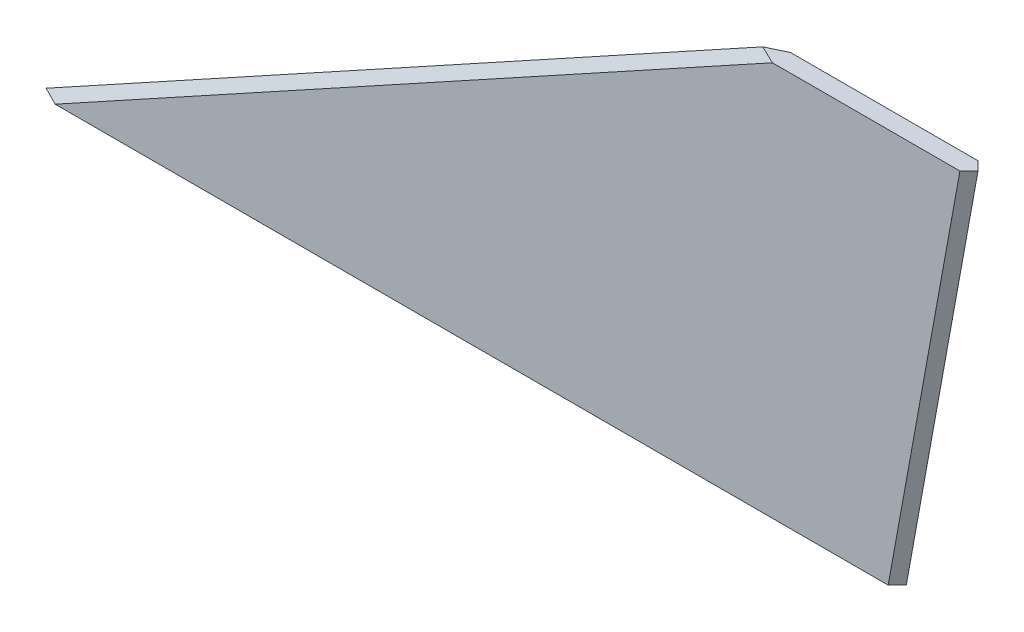
ISO-10303-21;
HEADER;
FILE_DESCRIPTION(('STEP AP214'),'2;1');
FILE_NAME('part.step','',(''),(''),'','','');
FILE_SCHEMA(('AUTOMOTIVE_DESIGN { 1 0 10303 214 1 1 1 1 }'));
ENDSEC;
DATA;
#1=APPLICATION_CONTEXT('core data for automotive mechanical design processes');
#2=APPLICATION_PROTOCOL_DEFINITION('international standard','automotive_design',2000,#1);
#3=PRODUCT_CONTEXT('',#1,'mechanical');
#4=PRODUCT('Part','Part','',(#3));
#5=PRODUCT_RELATED_PRODUCT_CATEGORY('part','',(#4));
#6=PRODUCT_DEFINITION_FORMATION('','',#4);
#7=PRODUCT_DEFINITION_CONTEXT('part definition',#1,'design');
#8=PRODUCT_DEFINITION('design','',#6,#7);
#9=PRODUCT_DEFINITION_SHAPE('','',#8);
#10=(LENGTH_UNIT() NAMED_UNIT(*) SI_UNIT(.MILLI.,.METRE.));
#11=(NAMED_UNIT(*) PLANE_ANGLE_UNIT() SI_UNIT($,.RADIAN.));
#12=(NAMED_UNIT(*) SI_UNIT($,.STERADIAN.) SOLID_ANGLE_UNIT());
#13=UNCERTAINTY_MEASURE_WITH_UNIT(LENGTH_MEASURE(1.E-05),#10,'distance_accuracy_value','');
#14=(GEOMETRIC_REPRESENTATION_CONTEXT(3) GLOBAL_UNCERTAINTY_ASSIGNED_CONTEXT((#13)) GLOBAL_UNIT_ASSIGNED_CONTEXT((#10,
#11,#12)) REPRESENTATION_CONTEXT('',''));
#15=CARTESIAN_POINT('',(0.,0.,0.));
#16=DIRECTION('',(0.,0.,1.));
#17=DIRECTION('',(1.,0.,0.));
#18=AXIS2_PLACEMENT_3D('',#15,#16,#17);
#19=CARTESIAN_POINT('',(0.,139.7,6.35));
#20=DIRECTION('',(0.,1.,0.));
#21=DIRECTION('',(0.,0.,1.));
#22=AXIS2_PLACEMENT_3D('',#19,#20,#21);
#23=PLANE('',#22);
#24=DIRECTION('',(0.712832435640261,0.,-0.701334384369662));
#25=VECTOR('',#24,1.);
#26=CARTESIAN_POINT('',(160.828157030195,139.7,169.814859916153));
#27=LINE('',#26,#25);
#28=CARTESIAN_POINT('',(326.972947350653,139.7,6.35));
#29=VERTEX_POINT('',#28);
#30=CARTESIAN_POINT('',(330.2,139.7,3.17499999999991));
#31=VERTEX_POINT('',#30);
#32=EDGE_CURVE('E72',#29,#31,#27,.T.);
#33=ORIENTED_EDGE('',*,*,#32,.T.);
#34=DIRECTION('',(0.712832435640261,0.,0.701334384369662));
#35=VECTOR('',#34,1.);
#36=CARTESIAN_POINT('',(164.002737278739,139.7,-160.341485932413));
#37=LINE('',#36,#35);
#38=CARTESIAN_POINT('',(326.972947350654,139.7,0.));
#39=VERTEX_POINT('',#38);
#40=EDGE_CURVE('E133',#31,#39,#37,.F.);
#41=ORIENTED_EDGE('',*,*,#40,.T.);
#42=DIRECTION('',(1.,0.,0.));
#43=VECTOR('',#42,1.);
#44=CARTESIAN_POINT('',(0.,139.7,0.));
#45=LINE('',#44,#43);
#46=CARTESIAN_POINT('',(260.588247503342,139.7,0.));
#47=VERTEX_POINT('',#46);
#48=EDGE_CURVE('E140',#47,#39,#45,.T.);
#49=ORIENTED_EDGE('',*,*,#48,.F.);
#50=DIRECTION('',(-0.900847645138054,0.,0.434135370880124));
#51=VECTOR('',#50,1.);
#52=CARTESIAN_POINT('',(46.6305639440745,139.7,103.110219365029));
#53=LINE('',#52,#51);
#54=CARTESIAN_POINT('',(254.,139.7,3.17499999999998));
#55=VERTEX_POINT('',#54);
#56=EDGE_CURVE('E137',#47,#55,#53,.T.);
#57=ORIENTED_EDGE('',*,*,#56,.T.);
#58=DIRECTION('',(-0.900847645138055,0.,-0.434135370880122));
#59=VECTOR('',#58,1.);
#60=CARTESIAN_POINT('',(49.1139843425302,139.7,-95.5634125114463));
#61=LINE('',#60,#59);
#62=CARTESIAN_POINT('',(260.588247503342,139.7,6.35));
#63=VERTEX_POINT('',#62);
#64=EDGE_CURVE('E118',#55,#63,#61,.F.);
#65=ORIENTED_EDGE('',*,*,#64,.T.);
#66=DIRECTION('',(1.,0.,0.));
#67=VECTOR('',#66,1.);
#68=CARTESIAN_POINT('',(0.,139.7,6.35));
#69=LINE('',#68,#67);
#70=EDGE_CURVE('E139',#63,#29,#69,.T.);
#71=ORIENTED_EDGE('',*,*,#70,.T.);
#72=EDGE_LOOP('',(#33,#41,#49,#57,#65,#71));
#73=FACE_BOUND('',#72,.T.);
#74=ADVANCED_FACE('F49',(#73),#23,.T.);
#75=CARTESIAN_POINT('',(0.,0.,6.35));
#76=DIRECTION('',(0.,0.,1.));
#77=DIRECTION('',(1.,0.,0.));
#78=AXIS2_PLACEMENT_3D('',#75,#76,#77);
#79=PLANE('',#78);
#80=DIRECTION('',(1.,0.,0.));
#81=VECTOR('',#80,1.);
#82=CARTESIAN_POINT('',(0.,0.,6.35));
#83=LINE('',#82,#81);
#84=CARTESIAN_POINT('',(6.58824750334187,0.,6.35));
#85=VERTEX_POINT('',#84);
#86=CARTESIAN_POINT('',(301.572947350653,0.,6.35));
#87=VERTEX_POINT('',#86);
#88=EDGE_CURVE('E64',#85,#87,#83,.T.);
#89=ORIENTED_EDGE('',*,*,#88,.T.);
#90=DIRECTION('',(0.178885438199983,0.983869910099908,0.));
#91=VECTOR('',#90,1.);
#92=CARTESIAN_POINT('',(327.076213035433,140.267961266285,6.35));
#93=LINE('',#92,#91);
#94=EDGE_CURVE('E58',#87,#29,#93,.T.);
#95=ORIENTED_EDGE('',*,*,#94,.T.);
#96=ORIENTED_EDGE('',*,*,#70,.F.);
#97=DIRECTION('',(-0.876215908676647,-0.481918749772156,0.));
#98=VECTOR('',#97,1.);
#99=CARTESIAN_POINT('',(1.53009203052661,-2.78198551004839,6.35));
#100=LINE('',#99,#98);
#101=EDGE_CURVE('E127',#63,#85,#100,.T.);
#102=ORIENTED_EDGE('',*,*,#101,.T.);
#103=EDGE_LOOP('',(#89,#95,#96,#102));
#104=FACE_BOUND('',#103,.T.);
#105=ADVANCED_FACE('F159',(#104),#79,.T.);
#106=CARTESIAN_POINT('',(0.,0.,0.));
#107=DIRECTION('',(0.,0.,1.));
#108=DIRECTION('',(1.,0.,0.));
#109=AXIS2_PLACEMENT_3D('',#106,#107,#108);
#110=PLANE('',#109);
#111=ORIENTED_EDGE('',*,*,#48,.T.);
#112=DIRECTION('',(-0.178885438199983,-0.983869910099908,0.));
#113=VECTOR('',#112,1.);
#114=CARTESIAN_POINT('',(291.922613035433,-53.076838733715,0.));
#115=LINE('',#114,#113);
#116=CARTESIAN_POINT('',(301.572947350654,0.,0.));
#117=VERTEX_POINT('',#116);
#118=EDGE_CURVE('E129',#39,#117,#115,.T.);
#119=ORIENTED_EDGE('',*,*,#118,.T.);
#120=DIRECTION('',(1.,0.,0.));
#121=VECTOR('',#120,1.);
#122=CARTESIAN_POINT('',(0.,0.,0.));
#123=LINE('',#122,#121);
#124=CARTESIAN_POINT('',(6.58824750334192,0.,0.));
#125=VERTEX_POINT('',#124);
#126=EDGE_CURVE('E122',#125,#117,#123,.T.);
#127=ORIENTED_EDGE('',*,*,#126,.F.);
#128=DIRECTION('',(0.876215908676647,0.481918749772156,0.));
#129=VECTOR('',#128,1.);
#130=CARTESIAN_POINT('',(255.530092030527,136.918014489952,0.));
#131=LINE('',#130,#129);
#132=EDGE_CURVE('E114',#125,#47,#131,.T.);
#133=ORIENTED_EDGE('',*,*,#132,.T.);
#134=EDGE_LOOP('',(#111,#119,#127,#133));
#135=FACE_BOUND('',#134,.T.);
#136=ADVANCED_FACE('F157',(#135),#110,.F.);
#137=CARTESIAN_POINT('',(291.922613035433,-53.076838733715,6.35));
#138=DIRECTION('',(0.695701085237034,-0.126491106406733,0.707106781186558));
#139=DIRECTION('',(-0.178885438199983,-0.983869910099908,0.));
#140=AXIS2_PLACEMENT_3D('',#137,#138,#139);
#141=PLANE('',#140);
#142=CARTESIAN_POINT('',(295.581693787821,-50.7006841669814,3.175));
#143=DIRECTION('',(0.695701085237034,-0.126491106406733,0.707106781186558));
#144=DIRECTION('',(0.718331399842729,0.12250613020573,-0.68483008700115));
#145=AXIS2_PLACEMENT_3D('',#142,#143,#144);
#146=ELLIPSE('',#145,73.0198659711618,50.8);
#147=CARTESIAN_POINT('',(304.818057424185,0.0993158330185853,3.17499999999991));
#148=VERTEX_POINT('',#147);
#149=EDGE_CURVE('E120',#148,#87,#146,.T.);
#150=ORIENTED_EDGE('',*,*,#149,.F.);
#151=DIRECTION('',(-0.178885438199983,-0.983869910099908,0.));
#152=VECTOR('',#151,1.);
#153=CARTESIAN_POINT('',(304.8,0.,3.17499999999991));
#154=LINE('',#153,#152);
#155=EDGE_CURVE('E119',#31,#148,#154,.T.);
#156=ORIENTED_EDGE('',*,*,#155,.F.);
#157=ORIENTED_EDGE('',*,*,#32,.F.);
#158=ORIENTED_EDGE('',*,*,#94,.F.);
#159=EDGE_LOOP('',(#150,#156,#157,#158));
#160=FACE_BOUND('',#159,.T.);
#161=ADVANCED_FACE('F152',(#160),#141,.T.);
#162=CARTESIAN_POINT('',(295.0464,-53.6447999999999,3.17499999999998));
#163=DIRECTION('',(-0.695701085237034,0.126491106406733,0.707106781186557));
#164=DIRECTION('',(0.178885438199983,0.983869910099908,0.));
#165=AXIS2_PLACEMENT_3D('',#162,#163,#164);
#166=PLANE('',#165);
#167=CARTESIAN_POINT('',(295.581693787822,-50.7006841669814,3.175));
#168=DIRECTION('',(-0.695701085237034,0.126491106406733,0.707106781186557));
#169=DIRECTION('',(0.718331399842728,0.12250613020573,0.68483008700115));
#170=AXIS2_PLACEMENT_3D('',#167,#168,#169);
#171=ELLIPSE('',#170,73.0198659711618,50.8);
#172=EDGE_CURVE('E115',#117,#148,#171,.F.);
#173=ORIENTED_EDGE('',*,*,#172,.F.);
#174=ORIENTED_EDGE('',*,*,#118,.F.);
#175=ORIENTED_EDGE('',*,*,#40,.F.);
#176=ORIENTED_EDGE('',*,*,#155,.T.);
#177=EDGE_LOOP('',(#173,#174,#175,#176));
#178=FACE_BOUND('',#177,.T.);
#179=ADVANCED_FACE('F154',(#178),#166,.F.);
#180=CARTESIAN_POINT('',(1.53009203052658,-2.78198551004833,0.));
#181=DIRECTION('',(-0.340768015944835,0.619578210808791,-0.707106781186546));
#182=DIRECTION('',(-0.876215908676647,-0.481918749772156,0.));
#183=AXIS2_PLACEMENT_3D('',#180,#181,#182);
#184=PLANE('',#183);
#185=CARTESIAN_POINT('',(-92.1830621217844,-50.7006841669814,3.175));
#186=DIRECTION('',(-0.340768015944835,0.619578210808791,-0.707106781186546));
#187=DIRECTION('',(0.940147413605452,0.224573757864496,-0.256299566854098));
#188=AXIS2_PLACEMENT_3D('',#185,#186,#187);
#189=ELLIPSE('',#188,149.075023543946,50.8);
#190=CARTESIAN_POINT('',(0.180574241851992,0.0993158330185956,3.17499999999998));
#191=VERTEX_POINT('',#190);
#192=EDGE_CURVE('E102',#191,#125,#189,.T.);
#193=ORIENTED_EDGE('',*,*,#192,.F.);
#194=DIRECTION('',(-0.876215908676647,-0.481918749772156,0.));
#195=VECTOR('',#194,1.);
#196=CARTESIAN_POINT('',(0.,0.,3.17499999999998));
#197=LINE('',#196,#195);
#198=EDGE_CURVE('E112',#55,#191,#197,.T.);
#199=ORIENTED_EDGE('',*,*,#198,.F.);
#200=ORIENTED_EDGE('',*,*,#56,.F.);
#201=ORIENTED_EDGE('',*,*,#132,.F.);
#202=EDGE_LOOP('',(#193,#199,#200,#201));
#203=FACE_BOUND('',#202,.T.);
#204=ADVANCED_FACE('F52',(#203),#184,.T.);
#205=CARTESIAN_POINT('',(0.,0.,3.17499999999996));
#206=DIRECTION('',(0.340768015944834,-0.61957821080879,-0.707106781186548));
#207=DIRECTION('',(0.876215908676647,0.481918749772156,0.));
#208=AXIS2_PLACEMENT_3D('',#205,#206,#207);
#209=PLANE('',#208);
#210=CARTESIAN_POINT('',(-92.1830621217843,-50.7006841669814,3.175));
#211=DIRECTION('',(0.340768015944834,-0.61957821080879,-0.707106781186548));
#212=DIRECTION('',(0.940147413605452,0.224573757864495,0.256299566854098));
#213=AXIS2_PLACEMENT_3D('',#210,#211,#212);
#214=ELLIPSE('',#213,149.075023543946,50.8);
#215=EDGE_CURVE('E11',#85,#191,#214,.F.);
#216=ORIENTED_EDGE('',*,*,#215,.F.);
#217=ORIENTED_EDGE('',*,*,#101,.F.);
#218=ORIENTED_EDGE('',*,*,#64,.F.);
#219=ORIENTED_EDGE('',*,*,#198,.T.);
#220=EDGE_LOOP('',(#216,#217,#218,#219));
#221=FACE_BOUND('',#220,.T.);
#222=ADVANCED_FACE('F117',(#221),#209,.F.);
#223=CARTESIAN_POINT('',(-13.716,-50.7006841669814,3.175));
#224=DIRECTION('',(1.,0.,0.));
#225=DIRECTION('',(0.,0.,-1.));
#226=AXIS2_PLACEMENT_3D('',#223,#224,#225);
#227=CYLINDRICAL_SURFACE('',#226,50.8);
#228=ORIENTED_EDGE('',*,*,#149,.T.);
#229=ORIENTED_EDGE('',*,*,#88,.F.);
#230=ORIENTED_EDGE('',*,*,#215,.T.);
#231=ORIENTED_EDGE('',*,*,#192,.T.);
#232=ORIENTED_EDGE('',*,*,#126,.T.);
#233=ORIENTED_EDGE('',*,*,#172,.T.);
#234=EDGE_LOOP('',(#228,#229,#230,#231,#232,#233));
#235=FACE_BOUND('',#234,.T.);
#236=ADVANCED_FACE('F101',(#235),#227,.F.);
#237=CLOSED_SHELL('',(#74,#105,#136,#161,#179,#204,#222,#236));
#238=MANIFOLD_SOLID_BREP('B2',#237);
#239=ADVANCED_BREP_SHAPE_REPRESENTATION('',(#18,#238),#14);
#240=SHAPE_DEFINITION_REPRESENTATION(#9,#239);
ENDSEC;
END-ISO-10303-21;
